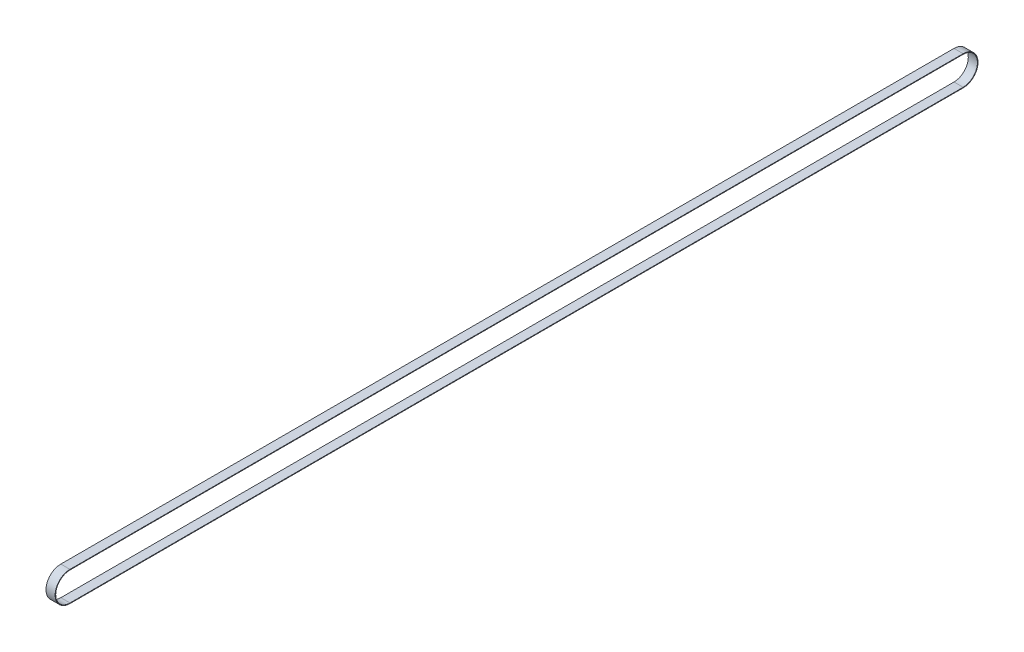
ISO-10303-21;
HEADER;
FILE_DESCRIPTION(('STEP AP214'),'2;1');
FILE_NAME('part.step','',(''),(''),'','','');
FILE_SCHEMA(('AUTOMOTIVE_DESIGN { 1 0 10303 214 1 1 1 1 }'));
ENDSEC;
DATA;
#1=APPLICATION_CONTEXT('core data for automotive mechanical design processes');
#2=APPLICATION_PROTOCOL_DEFINITION('international standard','automotive_design',2000,#1);
#3=PRODUCT_CONTEXT('',#1,'mechanical');
#4=PRODUCT('Part','Part','',(#3));
#5=PRODUCT_RELATED_PRODUCT_CATEGORY('part','',(#4));
#6=PRODUCT_DEFINITION_FORMATION('','',#4);
#7=PRODUCT_DEFINITION_CONTEXT('part definition',#1,'design');
#8=PRODUCT_DEFINITION('design','',#6,#7);
#9=PRODUCT_DEFINITION_SHAPE('','',#8);
#10=(LENGTH_UNIT() NAMED_UNIT(*) SI_UNIT(.MILLI.,.METRE.));
#11=(NAMED_UNIT(*) PLANE_ANGLE_UNIT() SI_UNIT($,.RADIAN.));
#12=(NAMED_UNIT(*) SI_UNIT($,.STERADIAN.) SOLID_ANGLE_UNIT());
#13=UNCERTAINTY_MEASURE_WITH_UNIT(LENGTH_MEASURE(1.E-05),#10,'distance_accuracy_value','');
#14=(GEOMETRIC_REPRESENTATION_CONTEXT(3) GLOBAL_UNCERTAINTY_ASSIGNED_CONTEXT((#13)) GLOBAL_UNIT_ASSIGNED_CONTEXT((#10,
#11,#12)) REPRESENTATION_CONTEXT('',''));
#15=CARTESIAN_POINT('',(0.,0.,0.));
#16=DIRECTION('',(0.,0.,1.));
#17=DIRECTION('',(1.,0.,0.));
#18=AXIS2_PLACEMENT_3D('',#15,#16,#17);
#19=CARTESIAN_POINT('',(-15.,0.,0.));
#20=DIRECTION('',(1.,0.,0.));
#21=DIRECTION('',(0.,0.,-1.));
#22=AXIS2_PLACEMENT_3D('',#19,#20,#21);
#23=CYLINDRICAL_SURFACE('',#22,24.35);
#24=CARTESIAN_POINT('',(0.,0.,0.));
#25=DIRECTION('',(1.,0.,0.));
#26=DIRECTION('',(0.,0.,-1.));
#27=AXIS2_PLACEMENT_3D('',#24,#25,#26);
#28=CIRCLE('',#27,24.35);
#29=CARTESIAN_POINT('',(0.,24.35,0.));
#30=VERTEX_POINT('',#29);
#31=CARTESIAN_POINT('',(0.,-24.35,0.));
#32=VERTEX_POINT('',#31);
#33=EDGE_CURVE('E130',#30,#32,#28,.T.);
#34=ORIENTED_EDGE('',*,*,#33,.F.);
#35=DIRECTION('',(1.,0.,0.));
#36=VECTOR('',#35,1.);
#37=CARTESIAN_POINT('',(-15.,24.35,0.));
#38=LINE('',#37,#36);
#39=CARTESIAN_POINT('',(-15.,24.35,0.));
#40=VERTEX_POINT('',#39);
#41=EDGE_CURVE('E11',#40,#30,#38,.T.);
#42=ORIENTED_EDGE('',*,*,#41,.F.);
#43=CARTESIAN_POINT('',(-15.,0.,0.));
#44=DIRECTION('',(1.,0.,0.));
#45=DIRECTION('',(0.,0.,-1.));
#46=AXIS2_PLACEMENT_3D('',#43,#44,#45);
#47=CIRCLE('',#46,24.35);
#48=CARTESIAN_POINT('',(-15.,-24.35,0.));
#49=VERTEX_POINT('',#48);
#50=EDGE_CURVE('E134',#40,#49,#47,.T.);
#51=ORIENTED_EDGE('',*,*,#50,.T.);
#52=DIRECTION('',(1.,0.,0.));
#53=VECTOR('',#52,1.);
#54=CARTESIAN_POINT('',(-15.,-24.35,0.));
#55=LINE('',#54,#53);
#56=EDGE_CURVE('E35',#49,#32,#55,.T.);
#57=ORIENTED_EDGE('',*,*,#56,.T.);
#58=EDGE_LOOP('',(#34,#42,#51,#57));
#59=FACE_BOUND('',#58,.T.);
#60=ADVANCED_FACE('F32',(#59),#23,.T.);
#61=CARTESIAN_POINT('',(-15.,24.35,0.));
#62=DIRECTION('',(0.,1.,0.));
#63=DIRECTION('',(0.,0.,1.));
#64=AXIS2_PLACEMENT_3D('',#61,#62,#63);
#65=PLANE('',#64);
#66=DIRECTION('',(0.,0.,1.));
#67=VECTOR('',#66,1.);
#68=CARTESIAN_POINT('',(0.,24.35,0.));
#69=LINE('',#68,#67);
#70=CARTESIAN_POINT('',(0.,24.35,-1465.));
#71=VERTEX_POINT('',#70);
#72=EDGE_CURVE('E138',#71,#30,#69,.T.);
#73=ORIENTED_EDGE('',*,*,#72,.F.);
#74=DIRECTION('',(1.,0.,0.));
#75=VECTOR('',#74,1.);
#76=CARTESIAN_POINT('',(-15.,24.35,-1465.));
#77=LINE('',#76,#75);
#78=CARTESIAN_POINT('',(-15.,24.35,-1465.));
#79=VERTEX_POINT('',#78);
#80=EDGE_CURVE('E40',#79,#71,#77,.T.);
#81=ORIENTED_EDGE('',*,*,#80,.F.);
#82=DIRECTION('',(0.,0.,1.));
#83=VECTOR('',#82,1.);
#84=CARTESIAN_POINT('',(-15.,24.35,0.));
#85=LINE('',#84,#83);
#86=EDGE_CURVE('E144',#79,#40,#85,.T.);
#87=ORIENTED_EDGE('',*,*,#86,.T.);
#88=ORIENTED_EDGE('',*,*,#41,.T.);
#89=EDGE_LOOP('',(#73,#81,#87,#88));
#90=FACE_BOUND('',#89,.T.);
#91=ADVANCED_FACE('F170',(#90),#65,.T.);
#92=CARTESIAN_POINT('',(-15.,0.,-1465.));
#93=DIRECTION('',(1.,0.,0.));
#94=DIRECTION('',(0.,0.,-1.));
#95=AXIS2_PLACEMENT_3D('',#92,#93,#94);
#96=CYLINDRICAL_SURFACE('',#95,24.35);
#97=CARTESIAN_POINT('',(0.,0.,-1465.));
#98=DIRECTION('',(1.,0.,0.));
#99=DIRECTION('',(0.,0.,-1.));
#100=AXIS2_PLACEMENT_3D('',#97,#98,#99);
#101=CIRCLE('',#100,24.35);
#102=CARTESIAN_POINT('',(0.,-24.35,-1465.));
#103=VERTEX_POINT('',#102);
#104=EDGE_CURVE('E152',#103,#71,#101,.T.);
#105=ORIENTED_EDGE('',*,*,#104,.F.);
#106=DIRECTION('',(1.,0.,0.));
#107=VECTOR('',#106,1.);
#108=CARTESIAN_POINT('',(-15.,-24.35,-1465.));
#109=LINE('',#108,#107);
#110=CARTESIAN_POINT('',(-15.,-24.35,-1465.));
#111=VERTEX_POINT('',#110);
#112=EDGE_CURVE('E157',#111,#103,#109,.T.);
#113=ORIENTED_EDGE('',*,*,#112,.F.);
#114=CARTESIAN_POINT('',(-15.,0.,-1465.));
#115=DIRECTION('',(1.,0.,0.));
#116=DIRECTION('',(0.,0.,-1.));
#117=AXIS2_PLACEMENT_3D('',#114,#115,#116);
#118=CIRCLE('',#117,24.35);
#119=EDGE_CURVE('E141',#111,#79,#118,.T.);
#120=ORIENTED_EDGE('',*,*,#119,.T.);
#121=ORIENTED_EDGE('',*,*,#80,.T.);
#122=EDGE_LOOP('',(#105,#113,#120,#121));
#123=FACE_BOUND('',#122,.T.);
#124=ADVANCED_FACE('F174',(#123),#96,.T.);
#125=CARTESIAN_POINT('',(-15.,-24.35,0.));
#126=DIRECTION('',(0.,-1.,0.));
#127=DIRECTION('',(0.,0.,-1.));
#128=AXIS2_PLACEMENT_3D('',#125,#126,#127);
#129=PLANE('',#128);
#130=DIRECTION('',(0.,0.,-1.));
#131=VECTOR('',#130,1.);
#132=CARTESIAN_POINT('',(0.,-24.35,0.));
#133=LINE('',#132,#131);
#134=EDGE_CURVE('E149',#32,#103,#133,.T.);
#135=ORIENTED_EDGE('',*,*,#134,.F.);
#136=ORIENTED_EDGE('',*,*,#56,.F.);
#137=DIRECTION('',(0.,0.,-1.));
#138=VECTOR('',#137,1.);
#139=CARTESIAN_POINT('',(-15.,-24.35,0.));
#140=LINE('',#139,#138);
#141=EDGE_CURVE('E137',#49,#111,#140,.T.);
#142=ORIENTED_EDGE('',*,*,#141,.T.);
#143=ORIENTED_EDGE('',*,*,#112,.T.);
#144=EDGE_LOOP('',(#135,#136,#142,#143));
#145=FACE_BOUND('',#144,.T.);
#146=ADVANCED_FACE('F165',(#145),#129,.T.);
#147=CARTESIAN_POINT('',(-15.,0.,0.));
#148=DIRECTION('',(1.,0.,0.));
#149=DIRECTION('',(0.,0.,-1.));
#150=AXIS2_PLACEMENT_3D('',#147,#148,#149);
#151=PLANE('',#150);
#152=DIRECTION('',(0.,0.,1.));
#153=VECTOR('',#152,1.);
#154=CARTESIAN_POINT('',(-15.,23.4,0.));
#155=LINE('',#154,#153);
#156=CARTESIAN_POINT('',(-15.,23.4,-1465.));
#157=VERTEX_POINT('',#156);
#158=CARTESIAN_POINT('',(-15.,23.4,0.));
#159=VERTEX_POINT('',#158);
#160=EDGE_CURVE('E105',#157,#159,#155,.T.);
#161=ORIENTED_EDGE('',*,*,#160,.T.);
#162=CARTESIAN_POINT('',(-15.,0.,0.));
#163=DIRECTION('',(1.,0.,0.));
#164=DIRECTION('',(0.,0.,-1.));
#165=AXIS2_PLACEMENT_3D('',#162,#163,#164);
#166=CIRCLE('',#165,23.4);
#167=CARTESIAN_POINT('',(-15.,-23.4,0.));
#168=VERTEX_POINT('',#167);
#169=EDGE_CURVE('E99',#159,#168,#166,.T.);
#170=ORIENTED_EDGE('',*,*,#169,.T.);
#171=DIRECTION('',(0.,0.,-1.));
#172=VECTOR('',#171,1.);
#173=CARTESIAN_POINT('',(-15.,-23.4,0.));
#174=LINE('',#173,#172);
#175=CARTESIAN_POINT('',(-15.,-23.4,-1465.));
#176=VERTEX_POINT('',#175);
#177=EDGE_CURVE('E108',#168,#176,#174,.T.);
#178=ORIENTED_EDGE('',*,*,#177,.T.);
#179=CARTESIAN_POINT('',(-15.,0.,-1465.));
#180=DIRECTION('',(1.,0.,0.));
#181=DIRECTION('',(0.,0.,-1.));
#182=AXIS2_PLACEMENT_3D('',#179,#180,#181);
#183=CIRCLE('',#182,23.4);
#184=EDGE_CURVE('E48',#176,#157,#183,.T.);
#185=ORIENTED_EDGE('',*,*,#184,.T.);
#186=EDGE_LOOP('',(#161,#170,#178,#185));
#187=FACE_BOUND('',#186,.T.);
#188=ORIENTED_EDGE('',*,*,#50,.F.);
#189=ORIENTED_EDGE('',*,*,#86,.F.);
#190=ORIENTED_EDGE('',*,*,#119,.F.);
#191=ORIENTED_EDGE('',*,*,#141,.F.);
#192=EDGE_LOOP('',(#188,#189,#190,#191));
#193=FACE_BOUND('',#192,.T.);
#194=ADVANCED_FACE('F112',(#187,#193),#151,.F.);
#195=CARTESIAN_POINT('',(0.,0.,0.));
#196=DIRECTION('',(1.,0.,0.));
#197=DIRECTION('',(0.,0.,-1.));
#198=AXIS2_PLACEMENT_3D('',#195,#196,#197);
#199=PLANE('',#198);
#200=CARTESIAN_POINT('',(0.,0.,0.));
#201=DIRECTION('',(1.,0.,0.));
#202=DIRECTION('',(0.,0.,-1.));
#203=AXIS2_PLACEMENT_3D('',#200,#201,#202);
#204=CIRCLE('',#203,23.4);
#205=CARTESIAN_POINT('',(0.,23.4,0.));
#206=VERTEX_POINT('',#205);
#207=CARTESIAN_POINT('',(0.,-23.4,0.));
#208=VERTEX_POINT('',#207);
#209=EDGE_CURVE('E56',#206,#208,#204,.T.);
#210=ORIENTED_EDGE('',*,*,#209,.F.);
#211=DIRECTION('',(0.,0.,1.));
#212=VECTOR('',#211,1.);
#213=CARTESIAN_POINT('',(0.,23.4,0.));
#214=LINE('',#213,#212);
#215=CARTESIAN_POINT('',(0.,23.4,-1465.));
#216=VERTEX_POINT('',#215);
#217=EDGE_CURVE('E115',#216,#206,#214,.T.);
#218=ORIENTED_EDGE('',*,*,#217,.F.);
#219=CARTESIAN_POINT('',(0.,0.,-1465.));
#220=DIRECTION('',(1.,0.,0.));
#221=DIRECTION('',(0.,0.,-1.));
#222=AXIS2_PLACEMENT_3D('',#219,#220,#221);
#223=CIRCLE('',#222,23.4);
#224=CARTESIAN_POINT('',(0.,-23.4,-1465.));
#225=VERTEX_POINT('',#224);
#226=EDGE_CURVE('E118',#225,#216,#223,.T.);
#227=ORIENTED_EDGE('',*,*,#226,.F.);
#228=DIRECTION('',(0.,0.,-1.));
#229=VECTOR('',#228,1.);
#230=CARTESIAN_POINT('',(0.,-23.4,0.));
#231=LINE('',#230,#229);
#232=EDGE_CURVE('E124',#208,#225,#231,.T.);
#233=ORIENTED_EDGE('',*,*,#232,.F.);
#234=EDGE_LOOP('',(#210,#218,#227,#233));
#235=FACE_BOUND('',#234,.T.);
#236=ORIENTED_EDGE('',*,*,#33,.T.);
#237=ORIENTED_EDGE('',*,*,#134,.T.);
#238=ORIENTED_EDGE('',*,*,#104,.T.);
#239=ORIENTED_EDGE('',*,*,#72,.T.);
#240=EDGE_LOOP('',(#236,#237,#238,#239));
#241=FACE_BOUND('',#240,.T.);
#242=ADVANCED_FACE('F167',(#235,#241),#199,.T.);
#243=CARTESIAN_POINT('',(-15.,0.,0.));
#244=DIRECTION('',(1.,0.,0.));
#245=DIRECTION('',(0.,0.,-1.));
#246=AXIS2_PLACEMENT_3D('',#243,#244,#245);
#247=CYLINDRICAL_SURFACE('',#246,23.4);
#248=ORIENTED_EDGE('',*,*,#209,.T.);
#249=DIRECTION('',(1.,0.,0.));
#250=VECTOR('',#249,1.);
#251=CARTESIAN_POINT('',(-15.,-23.4,0.));
#252=LINE('',#251,#250);
#253=EDGE_CURVE('E95',#168,#208,#252,.T.);
#254=ORIENTED_EDGE('',*,*,#253,.F.);
#255=ORIENTED_EDGE('',*,*,#169,.F.);
#256=DIRECTION('',(1.,0.,0.));
#257=VECTOR('',#256,1.);
#258=CARTESIAN_POINT('',(-15.,23.4,0.));
#259=LINE('',#258,#257);
#260=EDGE_CURVE('E128',#159,#206,#259,.T.);
#261=ORIENTED_EDGE('',*,*,#260,.T.);
#262=EDGE_LOOP('',(#248,#254,#255,#261));
#263=FACE_BOUND('',#262,.T.);
#264=ADVANCED_FACE('F97',(#263),#247,.F.);
#265=CARTESIAN_POINT('',(-15.,23.4,0.));
#266=DIRECTION('',(0.,1.,0.));
#267=DIRECTION('',(0.,0.,1.));
#268=AXIS2_PLACEMENT_3D('',#265,#266,#267);
#269=PLANE('',#268);
#270=ORIENTED_EDGE('',*,*,#217,.T.);
#271=ORIENTED_EDGE('',*,*,#260,.F.);
#272=ORIENTED_EDGE('',*,*,#160,.F.);
#273=DIRECTION('',(1.,0.,0.));
#274=VECTOR('',#273,1.);
#275=CARTESIAN_POINT('',(-15.,23.4,-1465.));
#276=LINE('',#275,#274);
#277=EDGE_CURVE('E131',#157,#216,#276,.T.);
#278=ORIENTED_EDGE('',*,*,#277,.T.);
#279=EDGE_LOOP('',(#270,#271,#272,#278));
#280=FACE_BOUND('',#279,.T.);
#281=ADVANCED_FACE('F225',(#280),#269,.F.);
#282=CARTESIAN_POINT('',(-15.,0.,-1465.));
#283=DIRECTION('',(1.,0.,0.));
#284=DIRECTION('',(0.,0.,-1.));
#285=AXIS2_PLACEMENT_3D('',#282,#283,#284);
#286=CYLINDRICAL_SURFACE('',#285,23.4);
#287=ORIENTED_EDGE('',*,*,#226,.T.);
#288=ORIENTED_EDGE('',*,*,#277,.F.);
#289=ORIENTED_EDGE('',*,*,#184,.F.);
#290=DIRECTION('',(1.,0.,0.));
#291=VECTOR('',#290,1.);
#292=CARTESIAN_POINT('',(-15.,-23.4,-1465.));
#293=LINE('',#292,#291);
#294=EDGE_CURVE('E104',#176,#225,#293,.T.);
#295=ORIENTED_EDGE('',*,*,#294,.T.);
#296=EDGE_LOOP('',(#287,#288,#289,#295));
#297=FACE_BOUND('',#296,.T.);
#298=ADVANCED_FACE('F234',(#297),#286,.F.);
#299=CARTESIAN_POINT('',(-15.,-23.4,0.));
#300=DIRECTION('',(0.,-1.,0.));
#301=DIRECTION('',(0.,0.,-1.));
#302=AXIS2_PLACEMENT_3D('',#299,#300,#301);
#303=PLANE('',#302);
#304=ORIENTED_EDGE('',*,*,#232,.T.);
#305=ORIENTED_EDGE('',*,*,#294,.F.);
#306=ORIENTED_EDGE('',*,*,#177,.F.);
#307=ORIENTED_EDGE('',*,*,#253,.T.);
#308=EDGE_LOOP('',(#304,#305,#306,#307));
#309=FACE_BOUND('',#308,.T.);
#310=ADVANCED_FACE('F109',(#309),#303,.F.);
#311=CLOSED_SHELL('',(#60,#91,#124,#146,#194,#242,#264,#281,#298,#310));
#312=MANIFOLD_SOLID_BREP('B2',#311);
#313=ADVANCED_BREP_SHAPE_REPRESENTATION('',(#18,#312),#14);
#314=SHAPE_DEFINITION_REPRESENTATION(#9,#313);
ENDSEC;
END-ISO-10303-21;
